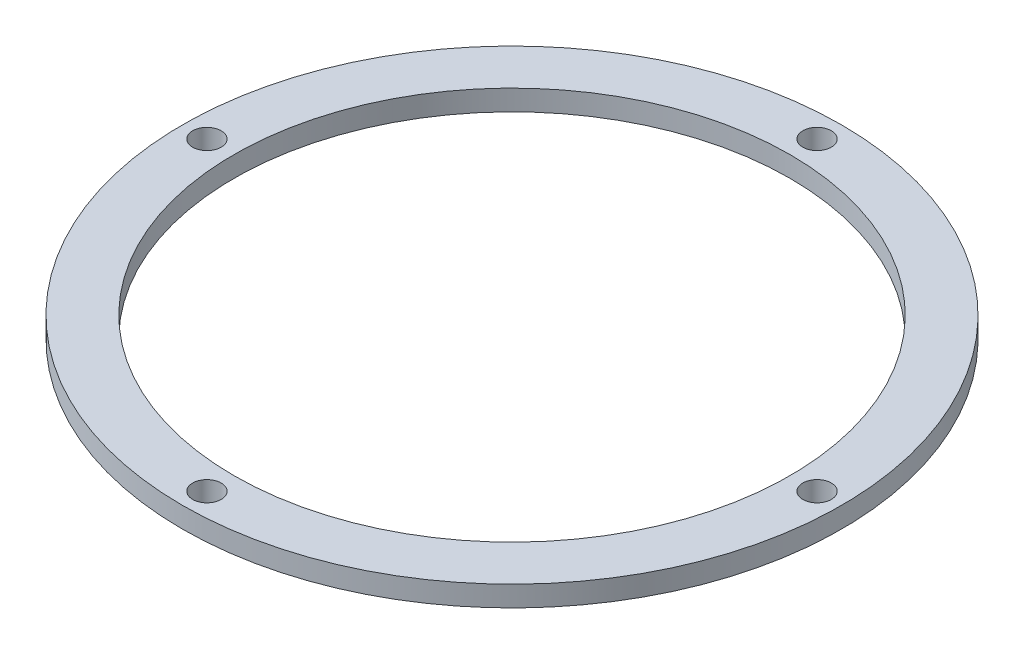
ISO-10303-21;
HEADER;
FILE_DESCRIPTION(('STEP AP214'),'2;1');
FILE_NAME('part.step','',(''),(''),'','','');
FILE_SCHEMA(('AUTOMOTIVE_DESIGN { 1 0 10303 214 1 1 1 1 }'));
ENDSEC;
DATA;
#1=APPLICATION_CONTEXT('core data for automotive mechanical design processes');
#2=APPLICATION_PROTOCOL_DEFINITION('international standard','automotive_design',2000,#1);
#3=PRODUCT_CONTEXT('',#1,'mechanical');
#4=PRODUCT('Part','Part','',(#3));
#5=PRODUCT_RELATED_PRODUCT_CATEGORY('part','',(#4));
#6=PRODUCT_DEFINITION_FORMATION('','',#4);
#7=PRODUCT_DEFINITION_CONTEXT('part definition',#1,'design');
#8=PRODUCT_DEFINITION('design','',#6,#7);
#9=PRODUCT_DEFINITION_SHAPE('','',#8);
#10=(LENGTH_UNIT() NAMED_UNIT(*) SI_UNIT(.MILLI.,.METRE.));
#11=(NAMED_UNIT(*) PLANE_ANGLE_UNIT() SI_UNIT($,.RADIAN.));
#12=(NAMED_UNIT(*) SI_UNIT($,.STERADIAN.) SOLID_ANGLE_UNIT());
#13=UNCERTAINTY_MEASURE_WITH_UNIT(LENGTH_MEASURE(1.E-05),#10,'distance_accuracy_value','');
#14=(GEOMETRIC_REPRESENTATION_CONTEXT(3) GLOBAL_UNCERTAINTY_ASSIGNED_CONTEXT((#13)) GLOBAL_UNIT_ASSIGNED_CONTEXT((#10,
#11,#12)) REPRESENTATION_CONTEXT('',''));
#15=CARTESIAN_POINT('',(0.,0.,0.));
#16=DIRECTION('',(0.,0.,1.));
#17=DIRECTION('',(1.,0.,0.));
#18=AXIS2_PLACEMENT_3D('',#15,#16,#17);
#19=CARTESIAN_POINT('',(0.,6.35,0.));
#20=DIRECTION('',(0.,-1.,0.));
#21=DIRECTION('',(0.,0.,-1.));
#22=AXIS2_PLACEMENT_3D('',#19,#20,#21);
#23=CYLINDRICAL_SURFACE('',#22,85.725);
#24=CARTESIAN_POINT('',(0.,6.35,0.));
#25=DIRECTION('',(0.,1.,0.));
#26=DIRECTION('',(0.,0.,1.));
#27=AXIS2_PLACEMENT_3D('',#24,#25,#26);
#28=CIRCLE('',#27,85.725);
#29=CARTESIAN_POINT('',(0.,6.35,85.725));
#30=VERTEX_POINT('',#29);
#31=EDGE_CURVE('E50',#30,#30,#28,.T.);
#32=ORIENTED_EDGE('',*,*,#31,.T.);
#33=EDGE_LOOP('',(#32));
#34=FACE_BOUND('',#33,.T.);
#35=CARTESIAN_POINT('',(0.,0.,0.));
#36=DIRECTION('',(0.,1.,0.));
#37=DIRECTION('',(0.,0.,1.));
#38=AXIS2_PLACEMENT_3D('',#35,#36,#37);
#39=CIRCLE('',#38,85.725);
#40=CARTESIAN_POINT('',(0.,0.,85.725));
#41=VERTEX_POINT('',#40);
#42=EDGE_CURVE('E70',#41,#41,#39,.T.);
#43=ORIENTED_EDGE('',*,*,#42,.F.);
#44=EDGE_LOOP('',(#43));
#45=FACE_BOUND('',#44,.T.);
#46=ADVANCED_FACE('F42',(#34,#45),#23,.F.);
#47=CARTESIAN_POINT('',(0.,6.35,-94.0452));
#48=DIRECTION('',(0.,-1.,0.));
#49=DIRECTION('',(0.,0.,-1.));
#50=AXIS2_PLACEMENT_3D('',#47,#48,#49);
#51=CYLINDRICAL_SURFACE('',#50,4.399999963);
#52=CARTESIAN_POINT('',(0.,6.35,-94.0452));
#53=DIRECTION('',(0.,1.,0.));
#54=DIRECTION('',(0.,0.,1.));
#55=AXIS2_PLACEMENT_3D('',#52,#53,#54);
#56=CIRCLE('',#55,4.399999963);
#57=CARTESIAN_POINT('',(0.,6.35,-89.645200037));
#58=VERTEX_POINT('',#57);
#59=EDGE_CURVE('E55',#58,#58,#56,.T.);
#60=ORIENTED_EDGE('',*,*,#59,.T.);
#61=EDGE_LOOP('',(#60));
#62=FACE_BOUND('',#61,.T.);
#63=CARTESIAN_POINT('',(0.,0.,-94.0452));
#64=DIRECTION('',(0.,1.,0.));
#65=DIRECTION('',(0.,0.,1.));
#66=AXIS2_PLACEMENT_3D('',#63,#64,#65);
#67=CIRCLE('',#66,4.399999963);
#68=CARTESIAN_POINT('',(0.,0.,-89.645200037));
#69=VERTEX_POINT('',#68);
#70=EDGE_CURVE('E68',#69,#69,#67,.T.);
#71=ORIENTED_EDGE('',*,*,#70,.F.);
#72=EDGE_LOOP('',(#71));
#73=FACE_BOUND('',#72,.T.);
#74=ADVANCED_FACE('F91',(#62,#73),#51,.F.);
#75=CARTESIAN_POINT('',(94.0452,6.35,3.2835706080777E-13));
#76=DIRECTION('',(0.,-1.,0.));
#77=DIRECTION('',(0.,0.,-1.));
#78=AXIS2_PLACEMENT_3D('',#75,#76,#77);
#79=CYLINDRICAL_SURFACE('',#78,4.399999963);
#80=CARTESIAN_POINT('',(94.0452,6.35,3.2835706080777E-13));
#81=DIRECTION('',(0.,1.,0.));
#82=DIRECTION('',(0.,0.,1.));
#83=AXIS2_PLACEMENT_3D('',#80,#81,#82);
#84=CIRCLE('',#83,4.399999963);
#85=CARTESIAN_POINT('',(94.0452,6.35,4.39999996300033));
#86=VERTEX_POINT('',#85);
#87=EDGE_CURVE('E84',#86,#86,#84,.T.);
#88=ORIENTED_EDGE('',*,*,#87,.T.);
#89=EDGE_LOOP('',(#88));
#90=FACE_BOUND('',#89,.T.);
#91=CARTESIAN_POINT('',(94.0452,0.,3.2835706080777E-13));
#92=DIRECTION('',(0.,1.,0.));
#93=DIRECTION('',(0.,0.,1.));
#94=AXIS2_PLACEMENT_3D('',#91,#92,#93);
#95=CIRCLE('',#94,4.399999963);
#96=CARTESIAN_POINT('',(94.0452,0.,4.39999996300033));
#97=VERTEX_POINT('',#96);
#98=EDGE_CURVE('E65',#97,#97,#95,.T.);
#99=ORIENTED_EDGE('',*,*,#98,.F.);
#100=EDGE_LOOP('',(#99));
#101=FACE_BOUND('',#100,.T.);
#102=ADVANCED_FACE('F109',(#90,#101),#79,.F.);
#103=CARTESIAN_POINT('',(-6.5671412161554E-13,6.35,94.0452));
#104=DIRECTION('',(0.,-1.,0.));
#105=DIRECTION('',(0.,0.,-1.));
#106=AXIS2_PLACEMENT_3D('',#103,#104,#105);
#107=CYLINDRICAL_SURFACE('',#106,4.399999963);
#108=CARTESIAN_POINT('',(-6.5671412161554E-13,6.35,94.0452));
#109=DIRECTION('',(0.,1.,0.));
#110=DIRECTION('',(0.,0.,1.));
#111=AXIS2_PLACEMENT_3D('',#108,#109,#110);
#112=CIRCLE('',#111,4.399999963);
#113=CARTESIAN_POINT('',(-6.5671412161554E-13,6.35,98.445199963));
#114=VERTEX_POINT('',#113);
#115=EDGE_CURVE('E79',#114,#114,#112,.T.);
#116=ORIENTED_EDGE('',*,*,#115,.T.);
#117=EDGE_LOOP('',(#116));
#118=FACE_BOUND('',#117,.T.);
#119=CARTESIAN_POINT('',(-6.5671412161554E-13,0.,94.0452));
#120=DIRECTION('',(0.,1.,0.));
#121=DIRECTION('',(0.,0.,1.));
#122=AXIS2_PLACEMENT_3D('',#119,#120,#121);
#123=CIRCLE('',#122,4.399999963);
#124=CARTESIAN_POINT('',(-6.5671412161554E-13,0.,98.445199963));
#125=VERTEX_POINT('',#124);
#126=EDGE_CURVE('E62',#125,#125,#123,.T.);
#127=ORIENTED_EDGE('',*,*,#126,.F.);
#128=EDGE_LOOP('',(#127));
#129=FACE_BOUND('',#128,.T.);
#130=ADVANCED_FACE('F115',(#118,#129),#107,.F.);
#131=CARTESIAN_POINT('',(-94.0452,6.35,-9.85071182423311E-13));
#132=DIRECTION('',(0.,-1.,0.));
#133=DIRECTION('',(0.,0.,-1.));
#134=AXIS2_PLACEMENT_3D('',#131,#132,#133);
#135=CYLINDRICAL_SURFACE('',#134,4.399999963);
#136=CARTESIAN_POINT('',(-94.0452,6.35,-9.85071182423311E-13));
#137=DIRECTION('',(0.,1.,0.));
#138=DIRECTION('',(0.,0.,1.));
#139=AXIS2_PLACEMENT_3D('',#136,#137,#138);
#140=CIRCLE('',#139,4.399999963);
#141=CARTESIAN_POINT('',(-94.0452,6.35,4.39999996299902));
#142=VERTEX_POINT('',#141);
#143=EDGE_CURVE('E75',#142,#142,#140,.T.);
#144=ORIENTED_EDGE('',*,*,#143,.T.);
#145=EDGE_LOOP('',(#144));
#146=FACE_BOUND('',#145,.T.);
#147=CARTESIAN_POINT('',(-94.0452,0.,-9.85071182423311E-13));
#148=DIRECTION('',(0.,1.,0.));
#149=DIRECTION('',(0.,0.,1.));
#150=AXIS2_PLACEMENT_3D('',#147,#148,#149);
#151=CIRCLE('',#150,4.399999963);
#152=CARTESIAN_POINT('',(-94.0452,0.,4.39999996299902));
#153=VERTEX_POINT('',#152);
#154=EDGE_CURVE('E59',#153,#153,#151,.T.);
#155=ORIENTED_EDGE('',*,*,#154,.F.);
#156=EDGE_LOOP('',(#155));
#157=FACE_BOUND('',#156,.T.);
#158=ADVANCED_FACE('F44',(#146,#157),#135,.F.);
#159=CARTESIAN_POINT('',(0.,6.35,0.));
#160=DIRECTION('',(0.,-1.,0.));
#161=DIRECTION('',(0.,0.,-1.));
#162=AXIS2_PLACEMENT_3D('',#159,#160,#161);
#163=CYLINDRICAL_SURFACE('',#162,101.6);
#164=CARTESIAN_POINT('',(0.,6.35,0.));
#165=DIRECTION('',(0.,1.,0.));
#166=DIRECTION('',(0.,0.,1.));
#167=AXIS2_PLACEMENT_3D('',#164,#165,#166);
#168=CIRCLE('',#167,101.6);
#169=CARTESIAN_POINT('',(0.,6.35,101.6));
#170=VERTEX_POINT('',#169);
#171=EDGE_CURVE('E10',#170,#170,#168,.T.);
#172=ORIENTED_EDGE('',*,*,#171,.F.);
#173=EDGE_LOOP('',(#172));
#174=FACE_BOUND('',#173,.T.);
#175=CARTESIAN_POINT('',(0.,0.,0.));
#176=DIRECTION('',(0.,1.,0.));
#177=DIRECTION('',(0.,0.,1.));
#178=AXIS2_PLACEMENT_3D('',#175,#176,#177);
#179=CIRCLE('',#178,101.6);
#180=CARTESIAN_POINT('',(0.,0.,101.6));
#181=VERTEX_POINT('',#180);
#182=EDGE_CURVE('E46',#181,#181,#179,.T.);
#183=ORIENTED_EDGE('',*,*,#182,.T.);
#184=EDGE_LOOP('',(#183));
#185=FACE_BOUND('',#184,.T.);
#186=ADVANCED_FACE('F98',(#174,#185),#163,.T.);
#187=CARTESIAN_POINT('',(0.,6.35,0.));
#188=DIRECTION('',(0.,1.,0.));
#189=DIRECTION('',(0.,0.,1.));
#190=AXIS2_PLACEMENT_3D('',#187,#188,#189);
#191=PLANE('',#190);
#192=ORIENTED_EDGE('',*,*,#143,.F.);
#193=EDGE_LOOP('',(#192));
#194=FACE_BOUND('',#193,.T.);
#195=ORIENTED_EDGE('',*,*,#115,.F.);
#196=EDGE_LOOP('',(#195));
#197=FACE_BOUND('',#196,.T.);
#198=ORIENTED_EDGE('',*,*,#87,.F.);
#199=EDGE_LOOP('',(#198));
#200=FACE_BOUND('',#199,.T.);
#201=ORIENTED_EDGE('',*,*,#59,.F.);
#202=EDGE_LOOP('',(#201));
#203=FACE_BOUND('',#202,.T.);
#204=ORIENTED_EDGE('',*,*,#31,.F.);
#205=EDGE_LOOP('',(#204));
#206=FACE_BOUND('',#205,.T.);
#207=ORIENTED_EDGE('',*,*,#171,.T.);
#208=EDGE_LOOP('',(#207));
#209=FACE_BOUND('',#208,.T.);
#210=ADVANCED_FACE('F94',(#194,#197,#200,#203,#206,#209),#191,.T.);
#211=CARTESIAN_POINT('',(0.,0.,0.));
#212=DIRECTION('',(0.,1.,0.));
#213=DIRECTION('',(0.,0.,1.));
#214=AXIS2_PLACEMENT_3D('',#211,#212,#213);
#215=PLANE('',#214);
#216=ORIENTED_EDGE('',*,*,#154,.T.);
#217=EDGE_LOOP('',(#216));
#218=FACE_BOUND('',#217,.T.);
#219=ORIENTED_EDGE('',*,*,#126,.T.);
#220=EDGE_LOOP('',(#219));
#221=FACE_BOUND('',#220,.T.);
#222=ORIENTED_EDGE('',*,*,#98,.T.);
#223=EDGE_LOOP('',(#222));
#224=FACE_BOUND('',#223,.T.);
#225=ORIENTED_EDGE('',*,*,#70,.T.);
#226=EDGE_LOOP('',(#225));
#227=FACE_BOUND('',#226,.T.);
#228=ORIENTED_EDGE('',*,*,#42,.T.);
#229=EDGE_LOOP('',(#228));
#230=FACE_BOUND('',#229,.T.);
#231=ORIENTED_EDGE('',*,*,#182,.F.);
#232=EDGE_LOOP('',(#231));
#233=FACE_BOUND('',#232,.T.);
#234=ADVANCED_FACE('F97',(#218,#221,#224,#227,#230,#233),#215,.F.);
#235=CLOSED_SHELL('',(#46,#74,#102,#130,#158,#186,#210,#234));
#236=MANIFOLD_SOLID_BREP('B2',#235);
#237=ADVANCED_BREP_SHAPE_REPRESENTATION('',(#18,#236),#14);
#238=SHAPE_DEFINITION_REPRESENTATION(#9,#237);
ENDSEC;
END-ISO-10303-21;
